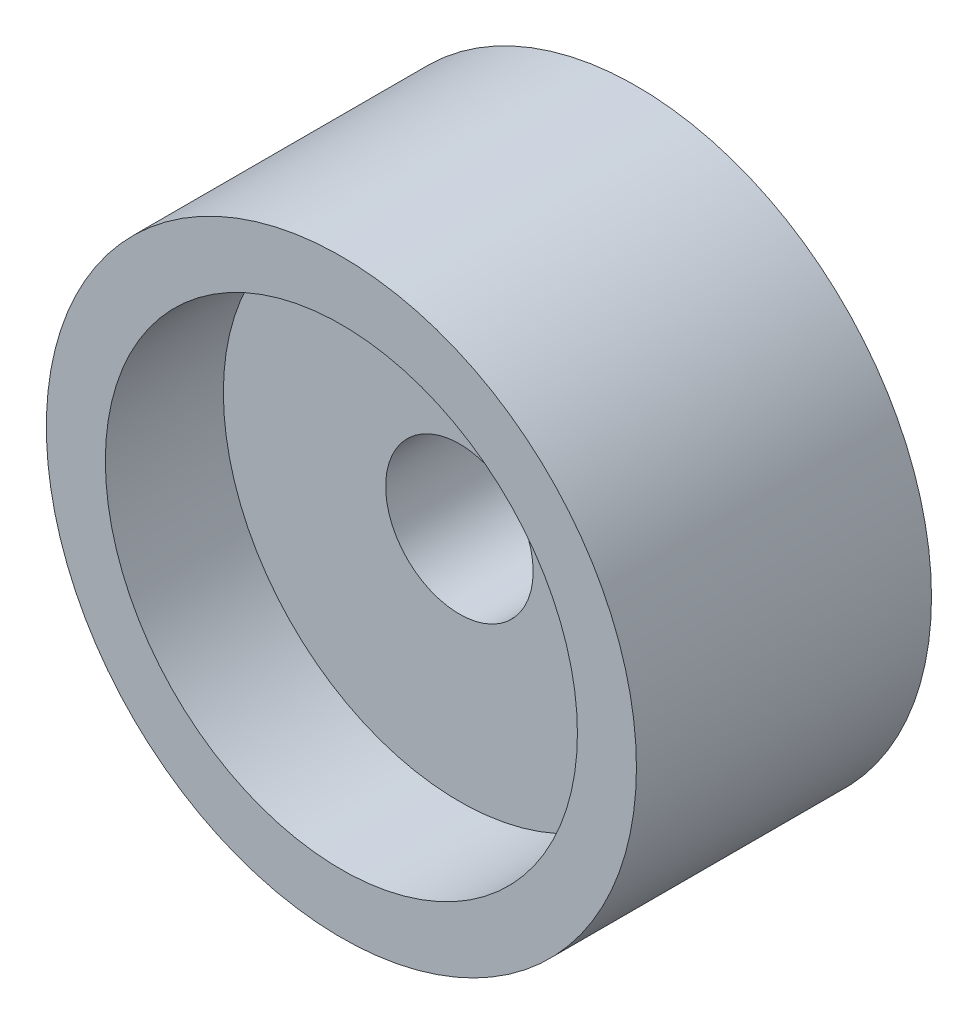
ISO-10303-21;
HEADER;
FILE_DESCRIPTION(('STEP AP214'),'2;1');
FILE_NAME('part.step','',(''),(''),'','','');
FILE_SCHEMA(('AUTOMOTIVE_DESIGN { 1 0 10303 214 1 1 1 1 }'));
ENDSEC;
DATA;
#1=APPLICATION_CONTEXT('core data for automotive mechanical design processes');
#2=APPLICATION_PROTOCOL_DEFINITION('international standard','automotive_design',2000,#1);
#3=PRODUCT_CONTEXT('',#1,'mechanical');
#4=PRODUCT('Part','Part','',(#3));
#5=PRODUCT_RELATED_PRODUCT_CATEGORY('part','',(#4));
#6=PRODUCT_DEFINITION_FORMATION('','',#4);
#7=PRODUCT_DEFINITION_CONTEXT('part definition',#1,'design');
#8=PRODUCT_DEFINITION('design','',#6,#7);
#9=PRODUCT_DEFINITION_SHAPE('','',#8);
#10=(LENGTH_UNIT() NAMED_UNIT(*) SI_UNIT(.MILLI.,.METRE.));
#11=(NAMED_UNIT(*) PLANE_ANGLE_UNIT() SI_UNIT($,.RADIAN.));
#12=(NAMED_UNIT(*) SI_UNIT($,.STERADIAN.) SOLID_ANGLE_UNIT());
#13=UNCERTAINTY_MEASURE_WITH_UNIT(LENGTH_MEASURE(1.E-05),#10,'distance_accuracy_value','');
#14=(GEOMETRIC_REPRESENTATION_CONTEXT(3) GLOBAL_UNCERTAINTY_ASSIGNED_CONTEXT((#13)) GLOBAL_UNIT_ASSIGNED_CONTEXT((#10,
#11,#12)) REPRESENTATION_CONTEXT('',''));
#15=CARTESIAN_POINT('',(0.,0.,0.));
#16=DIRECTION('',(0.,0.,1.));
#17=DIRECTION('',(1.,0.,0.));
#18=AXIS2_PLACEMENT_3D('',#15,#16,#17);
#19=CARTESIAN_POINT('',(0.,0.,2.));
#20=DIRECTION('',(0.,0.,-1.));
#21=DIRECTION('',(-1.,0.,0.));
#22=AXIS2_PLACEMENT_3D('',#19,#20,#21);
#23=CYLINDRICAL_SURFACE('',#22,4.);
#24=CARTESIAN_POINT('',(0.,0.,2.));
#25=DIRECTION('',(0.,0.,1.));
#26=DIRECTION('',(1.,0.,0.));
#27=AXIS2_PLACEMENT_3D('',#24,#25,#26);
#28=CIRCLE('',#27,4.);
#29=CARTESIAN_POINT('',(4.,0.,2.));
#30=VERTEX_POINT('',#29);
#31=EDGE_CURVE('E41',#30,#30,#28,.T.);
#32=ORIENTED_EDGE('',*,*,#31,.T.);
#33=EDGE_LOOP('',(#32));
#34=FACE_BOUND('',#33,.T.);
#35=CARTESIAN_POINT('',(0.,0.,0.));
#36=DIRECTION('',(0.,0.,1.));
#37=DIRECTION('',(1.,0.,0.));
#38=AXIS2_PLACEMENT_3D('',#35,#36,#37);
#39=CIRCLE('',#38,4.);
#40=CARTESIAN_POINT('',(4.,0.,0.));
#41=VERTEX_POINT('',#40);
#42=EDGE_CURVE('E37',#41,#41,#39,.T.);
#43=ORIENTED_EDGE('',*,*,#42,.F.);
#44=EDGE_LOOP('',(#43));
#45=FACE_BOUND('',#44,.T.);
#46=ADVANCED_FACE('F34',(#34,#45),#23,.F.);
#47=CARTESIAN_POINT('',(0.,0.,2.));
#48=DIRECTION('',(0.,0.,-1.));
#49=DIRECTION('',(-1.,0.,0.));
#50=AXIS2_PLACEMENT_3D('',#47,#48,#49);
#51=CYLINDRICAL_SURFACE('',#50,5.);
#52=CARTESIAN_POINT('',(0.,0.,2.));
#53=DIRECTION('',(0.,0.,1.));
#54=DIRECTION('',(1.,0.,0.));
#55=AXIS2_PLACEMENT_3D('',#52,#53,#54);
#56=CIRCLE('',#55,5.);
#57=CARTESIAN_POINT('',(5.,0.,2.));
#58=VERTEX_POINT('',#57);
#59=EDGE_CURVE('E10',#58,#58,#56,.T.);
#60=ORIENTED_EDGE('',*,*,#59,.F.);
#61=EDGE_LOOP('',(#60));
#62=FACE_BOUND('',#61,.T.);
#63=CARTESIAN_POINT('',(0.,0.,-3.));
#64=DIRECTION('',(0.,0.,1.));
#65=DIRECTION('',(1.,0.,0.));
#66=AXIS2_PLACEMENT_3D('',#63,#64,#65);
#67=CIRCLE('',#66,5.);
#68=CARTESIAN_POINT('',(5.,0.,-3.));
#69=VERTEX_POINT('',#68);
#70=EDGE_CURVE('E51',#69,#69,#67,.T.);
#71=ORIENTED_EDGE('',*,*,#70,.T.);
#72=EDGE_LOOP('',(#71));
#73=FACE_BOUND('',#72,.T.);
#74=ADVANCED_FACE('F75',(#62,#73),#51,.T.);
#75=CARTESIAN_POINT('',(0.,0.,2.));
#76=DIRECTION('',(0.,0.,1.));
#77=DIRECTION('',(1.,0.,0.));
#78=AXIS2_PLACEMENT_3D('',#75,#76,#77);
#79=PLANE('',#78);
#80=ORIENTED_EDGE('',*,*,#31,.F.);
#81=EDGE_LOOP('',(#80));
#82=FACE_BOUND('',#81,.T.);
#83=ORIENTED_EDGE('',*,*,#59,.T.);
#84=EDGE_LOOP('',(#83));
#85=FACE_BOUND('',#84,.T.);
#86=ADVANCED_FACE('F69',(#82,#85),#79,.T.);
#87=CARTESIAN_POINT('',(0.,0.,0.));
#88=DIRECTION('',(0.,0.,1.));
#89=DIRECTION('',(1.,0.,0.));
#90=AXIS2_PLACEMENT_3D('',#87,#88,#89);
#91=PLANE('',#90);
#92=CARTESIAN_POINT('',(0.,0.,0.));
#93=DIRECTION('',(0.,0.,1.));
#94=DIRECTION('',(1.,0.,0.));
#95=AXIS2_PLACEMENT_3D('',#92,#93,#94);
#96=CIRCLE('',#95,1.25);
#97=CARTESIAN_POINT('',(1.25,0.,0.));
#98=VERTEX_POINT('',#97);
#99=EDGE_CURVE('E47',#98,#98,#96,.T.);
#100=ORIENTED_EDGE('',*,*,#99,.F.);
#101=EDGE_LOOP('',(#100));
#102=FACE_BOUND('',#101,.T.);
#103=ORIENTED_EDGE('',*,*,#42,.T.);
#104=EDGE_LOOP('',(#103));
#105=FACE_BOUND('',#104,.T.);
#106=ADVANCED_FACE('F63',(#102,#105),#91,.T.);
#107=CARTESIAN_POINT('',(0.,0.,-3.));
#108=DIRECTION('',(0.,0.,1.));
#109=DIRECTION('',(1.,0.,0.));
#110=AXIS2_PLACEMENT_3D('',#107,#108,#109);
#111=CYLINDRICAL_SURFACE('',#110,1.25);
#112=CARTESIAN_POINT('',(0.,0.,-3.));
#113=DIRECTION('',(0.,0.,1.));
#114=DIRECTION('',(1.,0.,0.));
#115=AXIS2_PLACEMENT_3D('',#112,#113,#114);
#116=CIRCLE('',#115,1.25);
#117=CARTESIAN_POINT('',(1.25,0.,-3.));
#118=VERTEX_POINT('',#117);
#119=EDGE_CURVE('E50',#118,#118,#116,.T.);
#120=ORIENTED_EDGE('',*,*,#119,.F.);
#121=EDGE_LOOP('',(#120));
#122=FACE_BOUND('',#121,.T.);
#123=ORIENTED_EDGE('',*,*,#99,.T.);
#124=EDGE_LOOP('',(#123));
#125=FACE_BOUND('',#124,.T.);
#126=ADVANCED_FACE('F60',(#122,#125),#111,.F.);
#127=CARTESIAN_POINT('',(0.,0.,-3.));
#128=DIRECTION('',(0.,0.,1.));
#129=DIRECTION('',(1.,0.,0.));
#130=AXIS2_PLACEMENT_3D('',#127,#128,#129);
#131=PLANE('',#130);
#132=ORIENTED_EDGE('',*,*,#119,.T.);
#133=EDGE_LOOP('',(#132));
#134=FACE_BOUND('',#133,.T.);
#135=ORIENTED_EDGE('',*,*,#70,.F.);
#136=EDGE_LOOP('',(#135));
#137=FACE_BOUND('',#136,.T.);
#138=ADVANCED_FACE('F57',(#134,#137),#131,.F.);
#139=CLOSED_SHELL('',(#46,#74,#86,#106,#126,#138));
#140=MANIFOLD_SOLID_BREP('B2',#139);
#141=ADVANCED_BREP_SHAPE_REPRESENTATION('',(#18,#140),#14);
#142=SHAPE_DEFINITION_REPRESENTATION(#9,#141);
ENDSEC;
END-ISO-10303-21;
